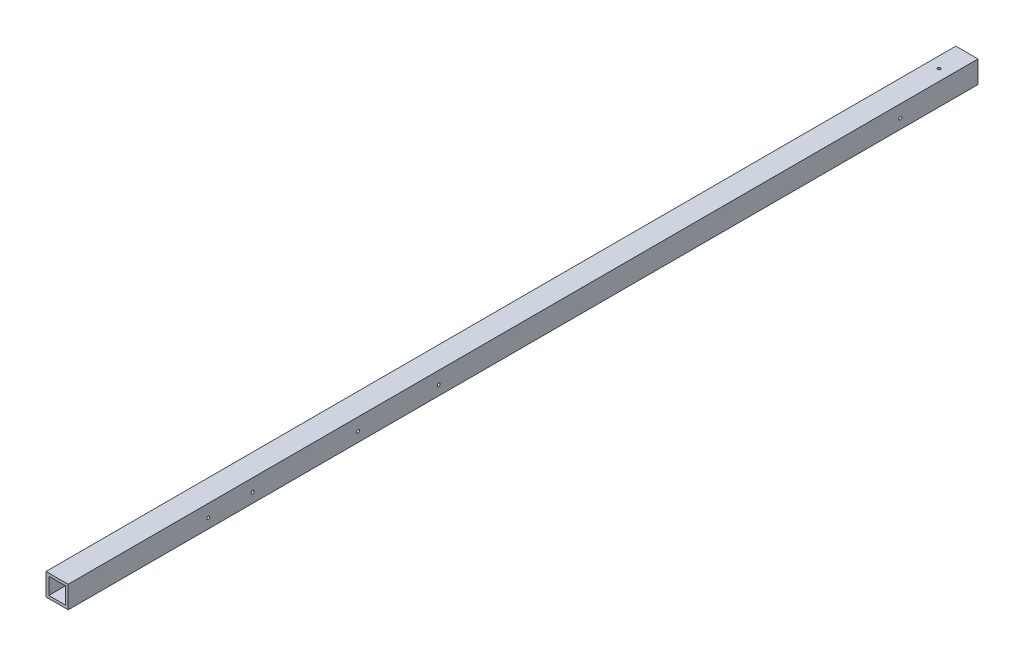
ISO-10303-21;
HEADER;
FILE_DESCRIPTION(('STEP AP214'),'2;1');
FILE_NAME('part.step','',(''),(''),'','','');
FILE_SCHEMA(('AUTOMOTIVE_DESIGN { 1 0 10303 214 1 1 1 1 }'));
ENDSEC;
DATA;
#1=APPLICATION_CONTEXT('core data for automotive mechanical design processes');
#2=APPLICATION_PROTOCOL_DEFINITION('international standard','automotive_design',2000,#1);
#3=PRODUCT_CONTEXT('',#1,'mechanical');
#4=PRODUCT('Part','Part','',(#3));
#5=PRODUCT_RELATED_PRODUCT_CATEGORY('part','',(#4));
#6=PRODUCT_DEFINITION_FORMATION('','',#4);
#7=PRODUCT_DEFINITION_CONTEXT('part definition',#1,'design');
#8=PRODUCT_DEFINITION('design','',#6,#7);
#9=PRODUCT_DEFINITION_SHAPE('','',#8);
#10=(LENGTH_UNIT() NAMED_UNIT(*) SI_UNIT(.MILLI.,.METRE.));
#11=(NAMED_UNIT(*) PLANE_ANGLE_UNIT() SI_UNIT($,.RADIAN.));
#12=(NAMED_UNIT(*) SI_UNIT($,.STERADIAN.) SOLID_ANGLE_UNIT());
#13=UNCERTAINTY_MEASURE_WITH_UNIT(LENGTH_MEASURE(1.E-05),#10,'distance_accuracy_value','');
#14=(GEOMETRIC_REPRESENTATION_CONTEXT(3) GLOBAL_UNCERTAINTY_ASSIGNED_CONTEXT((#13)) GLOBAL_UNIT_ASSIGNED_CONTEXT((#10,
#11,#12)) REPRESENTATION_CONTEXT('',''));
#15=CARTESIAN_POINT('',(0.,0.,0.));
#16=DIRECTION('',(0.,0.,1.));
#17=DIRECTION('',(1.,0.,0.));
#18=AXIS2_PLACEMENT_3D('',#15,#16,#17);
#19=CARTESIAN_POINT('',(-2287.62139438171,-193.675,1762.125));
#20=DIRECTION('',(1.,0.,0.));
#21=DIRECTION('',(0.,0.,-1.));
#22=AXIS2_PLACEMENT_3D('',#19,#20,#21);
#23=CYLINDRICAL_SURFACE('',#22,3.3782);
#24=CARTESIAN_POINT('',(-209.55,-193.675,1762.125));
#25=DIRECTION('',(1.,0.,0.));
#26=DIRECTION('',(0.,0.,-1.));
#27=AXIS2_PLACEMENT_3D('',#24,#25,#26);
#28=CIRCLE('',#27,3.3782);
#29=CARTESIAN_POINT('',(-209.55,-193.675,1758.7468));
#30=VERTEX_POINT('',#29);
#31=EDGE_CURVE('E163',#30,#30,#28,.F.);
#32=ORIENTED_EDGE('',*,*,#31,.F.);
#33=EDGE_LOOP('',(#32));
#34=FACE_BOUND('',#33,.T.);
#35=CARTESIAN_POINT('',(-212.028435125498,-193.675,1762.125));
#36=DIRECTION('',(-1.,0.,0.));
#37=DIRECTION('',(0.,0.,1.));
#38=AXIS2_PLACEMENT_3D('',#35,#36,#37);
#39=CIRCLE('',#38,3.3782);
#40=CARTESIAN_POINT('',(-212.028435125498,-193.675,1765.5032));
#41=VERTEX_POINT('',#40);
#42=EDGE_CURVE('E226',#41,#41,#39,.T.);
#43=ORIENTED_EDGE('',*,*,#42,.T.);
#44=EDGE_LOOP('',(#43));
#45=FACE_BOUND('',#44,.T.);
#46=ADVANCED_FACE('F16',(#34,#45),#23,.F.);
#47=CARTESIAN_POINT('',(-2287.62139438171,-193.675,1660.525));
#48=DIRECTION('',(1.,0.,0.));
#49=DIRECTION('',(0.,0.,-1.));
#50=AXIS2_PLACEMENT_3D('',#47,#48,#49);
#51=CYLINDRICAL_SURFACE('',#50,3.3782);
#52=CARTESIAN_POINT('',(-209.55,-193.675,1660.525));
#53=DIRECTION('',(1.,0.,0.));
#54=DIRECTION('',(0.,0.,-1.));
#55=AXIS2_PLACEMENT_3D('',#52,#53,#54);
#56=CIRCLE('',#55,3.3782);
#57=CARTESIAN_POINT('',(-209.55,-193.675,1657.1468));
#58=VERTEX_POINT('',#57);
#59=EDGE_CURVE('E169',#58,#58,#56,.F.);
#60=ORIENTED_EDGE('',*,*,#59,.F.);
#61=EDGE_LOOP('',(#60));
#62=FACE_BOUND('',#61,.T.);
#63=CARTESIAN_POINT('',(-212.028435125498,-193.675,1660.525));
#64=DIRECTION('',(-1.,0.,0.));
#65=DIRECTION('',(0.,0.,1.));
#66=AXIS2_PLACEMENT_3D('',#63,#64,#65);
#67=CIRCLE('',#66,3.3782);
#68=CARTESIAN_POINT('',(-212.028435125498,-193.675,1663.9032));
#69=VERTEX_POINT('',#68);
#70=EDGE_CURVE('E174',#69,#69,#67,.T.);
#71=ORIENTED_EDGE('',*,*,#70,.T.);
#72=EDGE_LOOP('',(#71));
#73=FACE_BOUND('',#72,.T.);
#74=ADVANCED_FACE('F411',(#62,#73),#51,.F.);
#75=CARTESIAN_POINT('',(-190.5,-171.45,2082.8));
#76=DIRECTION('',(0.,-1.,0.));
#77=DIRECTION('',(0.,0.,-1.));
#78=AXIS2_PLACEMENT_3D('',#75,#76,#77);
#79=PLANE('',#78);
#80=CARTESIAN_POINT('',(-190.5,-171.45,63.5));
#81=DIRECTION('',(0.,-1.,0.));
#82=DIRECTION('',(0.,0.,-1.));
#83=AXIS2_PLACEMENT_3D('',#80,#81,#82);
#84=CIRCLE('',#83,3.3655);
#85=CARTESIAN_POINT('',(-190.5,-171.45,60.1345));
#86=VERTEX_POINT('',#85);
#87=EDGE_CURVE('E256',#86,#86,#84,.F.);
#88=ORIENTED_EDGE('',*,*,#87,.T.);
#89=EDGE_LOOP('',(#88));
#90=FACE_BOUND('',#89,.T.);
#91=DIRECTION('',(-1.,0.,0.));
#92=VECTOR('',#91,1.);
#93=CARTESIAN_POINT('',(-190.5,-171.45,0.));
#94=LINE('',#93,#92);
#95=CARTESIAN_POINT('',(-171.45,-171.45,0.));
#96=VERTEX_POINT('',#95);
#97=CARTESIAN_POINT('',(-209.55,-171.45,0.));
#98=VERTEX_POINT('',#97);
#99=EDGE_CURVE('E293',#96,#98,#94,.T.);
#100=ORIENTED_EDGE('',*,*,#99,.F.);
#101=DIRECTION('',(0.,0.,-1.));
#102=VECTOR('',#101,1.);
#103=CARTESIAN_POINT('',(-171.45,-171.45,2082.8));
#104=LINE('',#103,#102);
#105=CARTESIAN_POINT('',(-171.45,-171.45,2082.8));
#106=VERTEX_POINT('',#105);
#107=EDGE_CURVE('E11',#106,#96,#104,.T.);
#108=ORIENTED_EDGE('',*,*,#107,.F.);
#109=DIRECTION('',(-1.,0.,0.));
#110=VECTOR('',#109,1.);
#111=CARTESIAN_POINT('',(-190.5,-171.45,2082.8));
#112=LINE('',#111,#110);
#113=CARTESIAN_POINT('',(-209.55,-171.45,2082.8));
#114=VERTEX_POINT('',#113);
#115=EDGE_CURVE('E130',#106,#114,#112,.T.);
#116=ORIENTED_EDGE('',*,*,#115,.T.);
#117=DIRECTION('',(0.,0.,-1.));
#118=VECTOR('',#117,1.);
#119=CARTESIAN_POINT('',(-209.55,-171.45,2082.8));
#120=LINE('',#119,#118);
#121=EDGE_CURVE('E41',#114,#98,#120,.T.);
#122=ORIENTED_EDGE('',*,*,#121,.T.);
#123=EDGE_LOOP('',(#100,#108,#116,#122));
#124=FACE_BOUND('',#123,.T.);
#125=ADVANCED_FACE('F406',(#90,#124),#79,.T.);
#126=CARTESIAN_POINT('',(-171.45,-190.5,2082.8));
#127=DIRECTION('',(1.,0.,0.));
#128=DIRECTION('',(0.,0.,-1.));
#129=AXIS2_PLACEMENT_3D('',#126,#127,#128);
#130=PLANE('',#129);
#131=CARTESIAN_POINT('',(-171.45,-193.675,1419.225));
#132=DIRECTION('',(1.,0.,0.));
#133=DIRECTION('',(0.,0.,-1.));
#134=AXIS2_PLACEMENT_3D('',#131,#132,#133);
#135=CIRCLE('',#134,3.3782);
#136=CARTESIAN_POINT('',(-171.45,-193.675,1415.8468));
#137=VERTEX_POINT('',#136);
#138=EDGE_CURVE('E201',#137,#137,#135,.F.);
#139=ORIENTED_EDGE('',*,*,#138,.F.);
#140=EDGE_LOOP('',(#139));
#141=FACE_BOUND('',#140,.T.);
#142=CARTESIAN_POINT('',(-171.45,-193.675,177.8));
#143=DIRECTION('',(1.,0.,0.));
#144=DIRECTION('',(0.,0.,-1.));
#145=AXIS2_PLACEMENT_3D('',#142,#143,#144);
#146=CIRCLE('',#145,3.3782);
#147=CARTESIAN_POINT('',(-171.45,-193.675,174.4218));
#148=VERTEX_POINT('',#147);
#149=EDGE_CURVE('E191',#148,#148,#146,.F.);
#150=ORIENTED_EDGE('',*,*,#149,.F.);
#151=EDGE_LOOP('',(#150));
#152=FACE_BOUND('',#151,.T.);
#153=CARTESIAN_POINT('',(-171.45,-193.675,1234.5416));
#154=DIRECTION('',(1.,0.,0.));
#155=DIRECTION('',(0.,0.,-1.));
#156=AXIS2_PLACEMENT_3D('',#153,#154,#155);
#157=CIRCLE('',#156,3.3782);
#158=CARTESIAN_POINT('',(-171.45,-193.675,1231.1634));
#159=VERTEX_POINT('',#158);
#160=EDGE_CURVE('E218',#159,#159,#157,.F.);
#161=ORIENTED_EDGE('',*,*,#160,.F.);
#162=EDGE_LOOP('',(#161));
#163=FACE_BOUND('',#162,.T.);
#164=CARTESIAN_POINT('',(-171.45,-193.675,1660.525));
#165=DIRECTION('',(1.,0.,0.));
#166=DIRECTION('',(0.,0.,-1.));
#167=AXIS2_PLACEMENT_3D('',#164,#165,#166);
#168=CIRCLE('',#167,3.3782);
#169=CARTESIAN_POINT('',(-171.45,-193.675,1657.1468));
#170=VERTEX_POINT('',#169);
#171=EDGE_CURVE('E168',#170,#170,#168,.F.);
#172=ORIENTED_EDGE('',*,*,#171,.F.);
#173=EDGE_LOOP('',(#172));
#174=FACE_BOUND('',#173,.T.);
#175=CARTESIAN_POINT('',(-171.45,-193.675,1762.125));
#176=DIRECTION('',(1.,0.,0.));
#177=DIRECTION('',(0.,0.,-1.));
#178=AXIS2_PLACEMENT_3D('',#175,#176,#177);
#179=CIRCLE('',#178,3.3782);
#180=CARTESIAN_POINT('',(-171.45,-193.675,1758.7468));
#181=VERTEX_POINT('',#180);
#182=EDGE_CURVE('E246',#181,#181,#179,.F.);
#183=ORIENTED_EDGE('',*,*,#182,.F.);
#184=EDGE_LOOP('',(#183));
#185=FACE_BOUND('',#184,.T.);
#186=DIRECTION('',(0.,-1.,0.));
#187=VECTOR('',#186,1.);
#188=CARTESIAN_POINT('',(-171.45,-190.5,0.));
#189=LINE('',#188,#187);
#190=CARTESIAN_POINT('',(-171.45,-209.55,0.));
#191=VERTEX_POINT('',#190);
#192=EDGE_CURVE('E136',#96,#191,#189,.T.);
#193=ORIENTED_EDGE('',*,*,#192,.T.);
#194=DIRECTION('',(0.,0.,-1.));
#195=VECTOR('',#194,1.);
#196=CARTESIAN_POINT('',(-171.45,-209.55,2082.8));
#197=LINE('',#196,#195);
#198=CARTESIAN_POINT('',(-171.45,-209.55,2082.8));
#199=VERTEX_POINT('',#198);
#200=EDGE_CURVE('E27',#199,#191,#197,.T.);
#201=ORIENTED_EDGE('',*,*,#200,.F.);
#202=DIRECTION('',(0.,-1.,0.));
#203=VECTOR('',#202,1.);
#204=CARTESIAN_POINT('',(-171.45,-190.5,2082.8));
#205=LINE('',#204,#203);
#206=EDGE_CURVE('E125',#106,#199,#205,.T.);
#207=ORIENTED_EDGE('',*,*,#206,.F.);
#208=ORIENTED_EDGE('',*,*,#107,.T.);
#209=EDGE_LOOP('',(#193,#201,#207,#208));
#210=FACE_BOUND('',#209,.T.);
#211=ADVANCED_FACE('F134',(#141,#152,#163,#174,#185,#210),#130,.F.);
#212=CARTESIAN_POINT('',(-190.5,-209.55,2082.8));
#213=DIRECTION('',(0.,-1.,0.));
#214=DIRECTION('',(0.,0.,-1.));
#215=AXIS2_PLACEMENT_3D('',#212,#213,#214);
#216=PLANE('',#215);
#217=CARTESIAN_POINT('',(-190.5,-209.55,63.5));
#218=DIRECTION('',(0.,-1.,0.));
#219=DIRECTION('',(0.,0.,-1.));
#220=AXIS2_PLACEMENT_3D('',#217,#218,#219);
#221=CIRCLE('',#220,3.3655);
#222=CARTESIAN_POINT('',(-190.5,-209.55,60.1345));
#223=VERTEX_POINT('',#222);
#224=EDGE_CURVE('E161',#223,#223,#221,.F.);
#225=ORIENTED_EDGE('',*,*,#224,.F.);
#226=EDGE_LOOP('',(#225));
#227=FACE_BOUND('',#226,.T.);
#228=DIRECTION('',(-1.,0.,0.));
#229=VECTOR('',#228,1.);
#230=CARTESIAN_POINT('',(-190.5,-209.55,0.));
#231=LINE('',#230,#229);
#232=CARTESIAN_POINT('',(-209.55,-209.55,0.));
#233=VERTEX_POINT('',#232);
#234=EDGE_CURVE('E298',#191,#233,#231,.T.);
#235=ORIENTED_EDGE('',*,*,#234,.T.);
#236=DIRECTION('',(0.,0.,-1.));
#237=VECTOR('',#236,1.);
#238=CARTESIAN_POINT('',(-209.55,-209.55,2082.8));
#239=LINE('',#238,#237);
#240=CARTESIAN_POINT('',(-209.55,-209.55,2082.8));
#241=VERTEX_POINT('',#240);
#242=EDGE_CURVE('E77',#241,#233,#239,.T.);
#243=ORIENTED_EDGE('',*,*,#242,.F.);
#244=DIRECTION('',(-1.,0.,0.));
#245=VECTOR('',#244,1.);
#246=CARTESIAN_POINT('',(-190.5,-209.55,2082.8));
#247=LINE('',#246,#245);
#248=EDGE_CURVE('E116',#199,#241,#247,.T.);
#249=ORIENTED_EDGE('',*,*,#248,.F.);
#250=ORIENTED_EDGE('',*,*,#200,.T.);
#251=EDGE_LOOP('',(#235,#243,#249,#250));
#252=FACE_BOUND('',#251,.T.);
#253=ADVANCED_FACE('F118',(#227,#252),#216,.F.);
#254=CARTESIAN_POINT('',(-215.9,-190.5,2082.8));
#255=DIRECTION('',(-1.,0.,0.));
#256=DIRECTION('',(0.,0.,1.));
#257=AXIS2_PLACEMENT_3D('',#254,#255,#256);
#258=PLANE('',#257);
#259=CARTESIAN_POINT('',(-215.9,-193.675,1419.225));
#260=DIRECTION('',(-1.,0.,0.));
#261=DIRECTION('',(0.,0.,1.));
#262=AXIS2_PLACEMENT_3D('',#259,#260,#261);
#263=CIRCLE('',#262,6.74369999999991);
#264=CARTESIAN_POINT('',(-215.9,-193.675,1425.9687));
#265=VERTEX_POINT('',#264);
#266=EDGE_CURVE('E714',#265,#265,#263,.T.);
#267=ORIENTED_EDGE('',*,*,#266,.F.);
#268=EDGE_LOOP('',(#267));
#269=FACE_BOUND('',#268,.T.);
#270=CARTESIAN_POINT('',(-215.9,-193.675,177.8));
#271=DIRECTION('',(-1.,0.,0.));
#272=DIRECTION('',(0.,0.,1.));
#273=AXIS2_PLACEMENT_3D('',#270,#271,#272);
#274=CIRCLE('',#273,6.7437);
#275=CARTESIAN_POINT('',(-215.9,-193.675,184.5437));
#276=VERTEX_POINT('',#275);
#277=EDGE_CURVE('E194',#276,#276,#274,.T.);
#278=ORIENTED_EDGE('',*,*,#277,.F.);
#279=EDGE_LOOP('',(#278));
#280=FACE_BOUND('',#279,.T.);
#281=CARTESIAN_POINT('',(-215.9,-193.675,1234.5416));
#282=DIRECTION('',(-1.,0.,0.));
#283=DIRECTION('',(0.,0.,1.));
#284=AXIS2_PLACEMENT_3D('',#281,#282,#283);
#285=CIRCLE('',#284,6.74369999999991);
#286=CARTESIAN_POINT('',(-215.9,-193.675,1241.2853));
#287=VERTEX_POINT('',#286);
#288=EDGE_CURVE('E208',#287,#287,#285,.T.);
#289=ORIENTED_EDGE('',*,*,#288,.F.);
#290=EDGE_LOOP('',(#289));
#291=FACE_BOUND('',#290,.T.);
#292=CARTESIAN_POINT('',(-215.9,-193.675,1762.125));
#293=DIRECTION('',(-1.,0.,0.));
#294=DIRECTION('',(0.,0.,1.));
#295=AXIS2_PLACEMENT_3D('',#292,#293,#294);
#296=CIRCLE('',#295,6.74369999999991);
#297=CARTESIAN_POINT('',(-215.9,-193.675,1768.8687));
#298=VERTEX_POINT('',#297);
#299=EDGE_CURVE('E222',#298,#298,#296,.T.);
#300=ORIENTED_EDGE('',*,*,#299,.F.);
#301=EDGE_LOOP('',(#300));
#302=FACE_BOUND('',#301,.T.);
#303=CARTESIAN_POINT('',(-215.9,-193.675,1660.525));
#304=DIRECTION('',(-1.,0.,0.));
#305=DIRECTION('',(0.,0.,1.));
#306=AXIS2_PLACEMENT_3D('',#303,#304,#305);
#307=CIRCLE('',#306,6.74369999999991);
#308=CARTESIAN_POINT('',(-215.9,-193.675,1667.2687));
#309=VERTEX_POINT('',#308);
#310=EDGE_CURVE('E230',#309,#309,#307,.T.);
#311=ORIENTED_EDGE('',*,*,#310,.F.);
#312=EDGE_LOOP('',(#311));
#313=FACE_BOUND('',#312,.T.);
#314=DIRECTION('',(0.,1.,0.));
#315=VECTOR('',#314,1.);
#316=CARTESIAN_POINT('',(-215.9,-190.5,0.));
#317=LINE('',#316,#315);
#318=CARTESIAN_POINT('',(-215.9,-215.9,0.));
#319=VERTEX_POINT('',#318);
#320=CARTESIAN_POINT('',(-215.9,-165.1,0.));
#321=VERTEX_POINT('',#320);
#322=EDGE_CURVE('E260',#319,#321,#317,.T.);
#323=ORIENTED_EDGE('',*,*,#322,.F.);
#324=DIRECTION('',(0.,0.,-1.));
#325=VECTOR('',#324,1.);
#326=CARTESIAN_POINT('',(-215.9,-215.9,2082.8));
#327=LINE('',#326,#325);
#328=CARTESIAN_POINT('',(-215.9,-215.9,2082.8));
#329=VERTEX_POINT('',#328);
#330=EDGE_CURVE('E94',#329,#319,#327,.T.);
#331=ORIENTED_EDGE('',*,*,#330,.F.);
#332=DIRECTION('',(0.,1.,0.));
#333=VECTOR('',#332,1.);
#334=CARTESIAN_POINT('',(-215.9,-190.5,2082.8));
#335=LINE('',#334,#333);
#336=CARTESIAN_POINT('',(-215.9,-165.1,2082.8));
#337=VERTEX_POINT('',#336);
#338=EDGE_CURVE('E261',#329,#337,#335,.T.);
#339=ORIENTED_EDGE('',*,*,#338,.T.);
#340=DIRECTION('',(0.,0.,-1.));
#341=VECTOR('',#340,1.);
#342=CARTESIAN_POINT('',(-215.9,-165.1,2082.8));
#343=LINE('',#342,#341);
#344=EDGE_CURVE('E147',#337,#321,#343,.T.);
#345=ORIENTED_EDGE('',*,*,#344,.T.);
#346=EDGE_LOOP('',(#323,#331,#339,#345));
#347=FACE_BOUND('',#346,.T.);
#348=ADVANCED_FACE('F18',(#269,#280,#291,#302,#313,#347),#258,.T.);
#349=CARTESIAN_POINT('',(-190.5,-215.9,2082.8));
#350=DIRECTION('',(0.,1.,0.));
#351=DIRECTION('',(0.,0.,1.));
#352=AXIS2_PLACEMENT_3D('',#349,#350,#351);
#353=PLANE('',#352);
#354=CARTESIAN_POINT('',(-190.5,-215.9,63.5));
#355=DIRECTION('',(0.,-1.,0.));
#356=DIRECTION('',(0.,0.,-1.));
#357=AXIS2_PLACEMENT_3D('',#354,#355,#356);
#358=CIRCLE('',#357,3.3655);
#359=CARTESIAN_POINT('',(-190.5,-215.9,60.1345));
#360=VERTEX_POINT('',#359);
#361=EDGE_CURVE('E162',#360,#360,#358,.T.);
#362=ORIENTED_EDGE('',*,*,#361,.F.);
#363=EDGE_LOOP('',(#362));
#364=FACE_BOUND('',#363,.T.);
#365=DIRECTION('',(1.,0.,0.));
#366=VECTOR('',#365,1.);
#367=CARTESIAN_POINT('',(-190.5,-215.9,0.));
#368=LINE('',#367,#366);
#369=CARTESIAN_POINT('',(-165.1,-215.9,0.));
#370=VERTEX_POINT('',#369);
#371=EDGE_CURVE('E282',#319,#370,#368,.T.);
#372=ORIENTED_EDGE('',*,*,#371,.T.);
#373=DIRECTION('',(0.,0.,-1.));
#374=VECTOR('',#373,1.);
#375=CARTESIAN_POINT('',(-165.1,-215.9,2082.8));
#376=LINE('',#375,#374);
#377=CARTESIAN_POINT('',(-165.1,-215.9,2082.8));
#378=VERTEX_POINT('',#377);
#379=EDGE_CURVE('E152',#378,#370,#376,.T.);
#380=ORIENTED_EDGE('',*,*,#379,.F.);
#381=DIRECTION('',(1.,0.,0.));
#382=VECTOR('',#381,1.);
#383=CARTESIAN_POINT('',(-190.5,-215.9,2082.8));
#384=LINE('',#383,#382);
#385=EDGE_CURVE('E264',#329,#378,#384,.T.);
#386=ORIENTED_EDGE('',*,*,#385,.F.);
#387=ORIENTED_EDGE('',*,*,#330,.T.);
#388=EDGE_LOOP('',(#372,#380,#386,#387));
#389=FACE_BOUND('',#388,.T.);
#390=ADVANCED_FACE('F384',(#364,#389),#353,.F.);
#391=CARTESIAN_POINT('',(-165.1,-190.5,2082.8));
#392=DIRECTION('',(-1.,0.,0.));
#393=DIRECTION('',(0.,0.,1.));
#394=AXIS2_PLACEMENT_3D('',#391,#392,#393);
#395=PLANE('',#394);
#396=CARTESIAN_POINT('',(-165.1,-193.675,1419.225));
#397=DIRECTION('',(-1.,0.,0.));
#398=DIRECTION('',(0.,0.,1.));
#399=AXIS2_PLACEMENT_3D('',#396,#397,#398);
#400=CIRCLE('',#399,3.3782);
#401=CARTESIAN_POINT('',(-165.1,-193.675,1422.6032));
#402=VERTEX_POINT('',#401);
#403=EDGE_CURVE('E702',#402,#402,#400,.F.);
#404=ORIENTED_EDGE('',*,*,#403,.F.);
#405=EDGE_LOOP('',(#404));
#406=FACE_BOUND('',#405,.T.);
#407=CARTESIAN_POINT('',(-165.1,-193.675,177.8));
#408=DIRECTION('',(-1.,0.,0.));
#409=DIRECTION('',(0.,0.,1.));
#410=AXIS2_PLACEMENT_3D('',#407,#408,#409);
#411=CIRCLE('',#410,3.3782);
#412=CARTESIAN_POINT('',(-165.1,-193.675,181.1782));
#413=VERTEX_POINT('',#412);
#414=EDGE_CURVE('E183',#413,#413,#411,.F.);
#415=ORIENTED_EDGE('',*,*,#414,.F.);
#416=EDGE_LOOP('',(#415));
#417=FACE_BOUND('',#416,.T.);
#418=CARTESIAN_POINT('',(-165.1,-193.675,1234.5416));
#419=DIRECTION('',(-1.,0.,0.));
#420=DIRECTION('',(0.,0.,1.));
#421=AXIS2_PLACEMENT_3D('',#418,#419,#420);
#422=CIRCLE('',#421,3.3782);
#423=CARTESIAN_POINT('',(-165.1,-193.675,1237.9198));
#424=VERTEX_POINT('',#423);
#425=EDGE_CURVE('E178',#424,#424,#422,.F.);
#426=ORIENTED_EDGE('',*,*,#425,.F.);
#427=EDGE_LOOP('',(#426));
#428=FACE_BOUND('',#427,.T.);
#429=CARTESIAN_POINT('',(-165.1,-193.675,1660.525));
#430=DIRECTION('',(-1.,0.,0.));
#431=DIRECTION('',(0.,0.,1.));
#432=AXIS2_PLACEMENT_3D('',#429,#430,#431);
#433=CIRCLE('',#432,3.3782);
#434=CARTESIAN_POINT('',(-165.1,-193.675,1663.9032));
#435=VERTEX_POINT('',#434);
#436=EDGE_CURVE('E173',#435,#435,#433,.F.);
#437=ORIENTED_EDGE('',*,*,#436,.F.);
#438=EDGE_LOOP('',(#437));
#439=FACE_BOUND('',#438,.T.);
#440=CARTESIAN_POINT('',(-165.1,-193.675,1762.125));
#441=DIRECTION('',(-1.,0.,0.));
#442=DIRECTION('',(0.,0.,1.));
#443=AXIS2_PLACEMENT_3D('',#440,#441,#442);
#444=CIRCLE('',#443,3.3782);
#445=CARTESIAN_POINT('',(-165.1,-193.675,1765.5032));
#446=VERTEX_POINT('',#445);
#447=EDGE_CURVE('E167',#446,#446,#444,.F.);
#448=ORIENTED_EDGE('',*,*,#447,.F.);
#449=EDGE_LOOP('',(#448));
#450=FACE_BOUND('',#449,.T.);
#451=DIRECTION('',(0.,1.,0.));
#452=VECTOR('',#451,1.);
#453=CARTESIAN_POINT('',(-165.1,-190.5,0.));
#454=LINE('',#453,#452);
#455=CARTESIAN_POINT('',(-165.1,-165.1,0.));
#456=VERTEX_POINT('',#455);
#457=EDGE_CURVE('E285',#370,#456,#454,.T.);
#458=ORIENTED_EDGE('',*,*,#457,.T.);
#459=DIRECTION('',(0.,0.,-1.));
#460=VECTOR('',#459,1.);
#461=CARTESIAN_POINT('',(-165.1,-165.1,2082.8));
#462=LINE('',#461,#460);
#463=CARTESIAN_POINT('',(-165.1,-165.1,2082.8));
#464=VERTEX_POINT('',#463);
#465=EDGE_CURVE('E150',#464,#456,#462,.T.);
#466=ORIENTED_EDGE('',*,*,#465,.F.);
#467=DIRECTION('',(0.,1.,0.));
#468=VECTOR('',#467,1.);
#469=CARTESIAN_POINT('',(-165.1,-190.5,2082.8));
#470=LINE('',#469,#468);
#471=EDGE_CURVE('E268',#378,#464,#470,.T.);
#472=ORIENTED_EDGE('',*,*,#471,.F.);
#473=ORIENTED_EDGE('',*,*,#379,.T.);
#474=EDGE_LOOP('',(#458,#466,#472,#473));
#475=FACE_BOUND('',#474,.T.);
#476=ADVANCED_FACE('F389',(#406,#417,#428,#439,#450,#475),#395,.F.);
#477=CARTESIAN_POINT('',(-190.5,-165.1,2082.8));
#478=DIRECTION('',(0.,1.,0.));
#479=DIRECTION('',(0.,0.,1.));
#480=AXIS2_PLACEMENT_3D('',#477,#478,#479);
#481=PLANE('',#480);
#482=CARTESIAN_POINT('',(-190.5,-165.1,63.5));
#483=DIRECTION('',(0.,1.,0.));
#484=DIRECTION('',(0.,0.,1.));
#485=AXIS2_PLACEMENT_3D('',#482,#483,#484);
#486=CIRCLE('',#485,3.3655);
#487=CARTESIAN_POINT('',(-190.5,-165.1,66.8655));
#488=VERTEX_POINT('',#487);
#489=EDGE_CURVE('E157',#488,#488,#486,.F.);
#490=ORIENTED_EDGE('',*,*,#489,.T.);
#491=EDGE_LOOP('',(#490));
#492=FACE_BOUND('',#491,.T.);
#493=DIRECTION('',(1.,0.,0.));
#494=VECTOR('',#493,1.);
#495=CARTESIAN_POINT('',(-190.5,-165.1,0.));
#496=LINE('',#495,#494);
#497=EDGE_CURVE('E289',#321,#456,#496,.T.);
#498=ORIENTED_EDGE('',*,*,#497,.F.);
#499=ORIENTED_EDGE('',*,*,#344,.F.);
#500=DIRECTION('',(1.,0.,0.));
#501=VECTOR('',#500,1.);
#502=CARTESIAN_POINT('',(-190.5,-165.1,2082.8));
#503=LINE('',#502,#501);
#504=EDGE_CURVE('E271',#337,#464,#503,.T.);
#505=ORIENTED_EDGE('',*,*,#504,.T.);
#506=ORIENTED_EDGE('',*,*,#465,.T.);
#507=EDGE_LOOP('',(#498,#499,#505,#506));
#508=FACE_BOUND('',#507,.T.);
#509=ADVANCED_FACE('F396',(#492,#508),#481,.T.);
#510=CARTESIAN_POINT('',(-209.55,-190.5,2082.8));
#511=DIRECTION('',(1.,0.,0.));
#512=DIRECTION('',(0.,0.,-1.));
#513=AXIS2_PLACEMENT_3D('',#510,#511,#512);
#514=PLANE('',#513);
#515=CARTESIAN_POINT('',(-209.55,-193.675,1419.225));
#516=DIRECTION('',(1.,0.,0.));
#517=DIRECTION('',(0.,0.,-1.));
#518=AXIS2_PLACEMENT_3D('',#515,#516,#517);
#519=CIRCLE('',#518,3.3782);
#520=CARTESIAN_POINT('',(-209.55,-193.675,1415.8468));
#521=VERTEX_POINT('',#520);
#522=EDGE_CURVE('E20',#521,#521,#519,.F.);
#523=ORIENTED_EDGE('',*,*,#522,.T.);
#524=EDGE_LOOP('',(#523));
#525=FACE_BOUND('',#524,.T.);
#526=CARTESIAN_POINT('',(-209.55,-193.675,177.8));
#527=DIRECTION('',(1.,0.,0.));
#528=DIRECTION('',(0.,0.,-1.));
#529=AXIS2_PLACEMENT_3D('',#526,#527,#528);
#530=CIRCLE('',#529,3.3782);
#531=CARTESIAN_POINT('',(-209.55,-193.675,174.4218));
#532=VERTEX_POINT('',#531);
#533=EDGE_CURVE('E180',#532,#532,#530,.F.);
#534=ORIENTED_EDGE('',*,*,#533,.T.);
#535=EDGE_LOOP('',(#534));
#536=FACE_BOUND('',#535,.T.);
#537=CARTESIAN_POINT('',(-209.55,-193.675,1234.5416));
#538=DIRECTION('',(1.,0.,0.));
#539=DIRECTION('',(0.,0.,-1.));
#540=AXIS2_PLACEMENT_3D('',#537,#538,#539);
#541=CIRCLE('',#540,3.3782);
#542=CARTESIAN_POINT('',(-209.55,-193.675,1231.1634));
#543=VERTEX_POINT('',#542);
#544=EDGE_CURVE('E175',#543,#543,#541,.F.);
#545=ORIENTED_EDGE('',*,*,#544,.T.);
#546=EDGE_LOOP('',(#545));
#547=FACE_BOUND('',#546,.T.);
#548=ORIENTED_EDGE('',*,*,#59,.T.);
#549=EDGE_LOOP('',(#548));
#550=FACE_BOUND('',#549,.T.);
#551=ORIENTED_EDGE('',*,*,#31,.T.);
#552=EDGE_LOOP('',(#551));
#553=FACE_BOUND('',#552,.T.);
#554=DIRECTION('',(0.,-1.,0.));
#555=VECTOR('',#554,1.);
#556=CARTESIAN_POINT('',(-209.55,-190.5,0.));
#557=LINE('',#556,#555);
#558=EDGE_CURVE('E265',#98,#233,#557,.T.);
#559=ORIENTED_EDGE('',*,*,#558,.F.);
#560=ORIENTED_EDGE('',*,*,#121,.F.);
#561=DIRECTION('',(0.,-1.,0.));
#562=VECTOR('',#561,1.);
#563=CARTESIAN_POINT('',(-209.55,-190.5,2082.8));
#564=LINE('',#563,#562);
#565=EDGE_CURVE('E124',#114,#241,#564,.T.);
#566=ORIENTED_EDGE('',*,*,#565,.T.);
#567=ORIENTED_EDGE('',*,*,#242,.T.);
#568=EDGE_LOOP('',(#559,#560,#566,#567));
#569=FACE_BOUND('',#568,.T.);
#570=ADVANCED_FACE('F369',(#525,#536,#547,#550,#553,#569),#514,.T.);
#571=CARTESIAN_POINT('',(-190.5,-190.5,2082.8));
#572=DIRECTION('',(0.,0.,1.));
#573=DIRECTION('',(1.,0.,0.));
#574=AXIS2_PLACEMENT_3D('',#571,#572,#573);
#575=PLANE('',#574);
#576=ORIENTED_EDGE('',*,*,#338,.F.);
#577=ORIENTED_EDGE('',*,*,#385,.T.);
#578=ORIENTED_EDGE('',*,*,#471,.T.);
#579=ORIENTED_EDGE('',*,*,#504,.F.);
#580=EDGE_LOOP('',(#576,#577,#578,#579));
#581=FACE_BOUND('',#580,.T.);
#582=ORIENTED_EDGE('',*,*,#115,.F.);
#583=ORIENTED_EDGE('',*,*,#206,.T.);
#584=ORIENTED_EDGE('',*,*,#248,.T.);
#585=ORIENTED_EDGE('',*,*,#565,.F.);
#586=EDGE_LOOP('',(#582,#583,#584,#585));
#587=FACE_BOUND('',#586,.T.);
#588=ADVANCED_FACE('F129',(#581,#587),#575,.T.);
#589=CARTESIAN_POINT('',(-190.5,-190.5,0.));
#590=DIRECTION('',(0.,0.,1.));
#591=DIRECTION('',(1.,0.,0.));
#592=AXIS2_PLACEMENT_3D('',#589,#590,#591);
#593=PLANE('',#592);
#594=ORIENTED_EDGE('',*,*,#322,.T.);
#595=ORIENTED_EDGE('',*,*,#497,.T.);
#596=ORIENTED_EDGE('',*,*,#457,.F.);
#597=ORIENTED_EDGE('',*,*,#371,.F.);
#598=EDGE_LOOP('',(#594,#595,#596,#597));
#599=FACE_BOUND('',#598,.T.);
#600=ORIENTED_EDGE('',*,*,#99,.T.);
#601=ORIENTED_EDGE('',*,*,#558,.T.);
#602=ORIENTED_EDGE('',*,*,#234,.F.);
#603=ORIENTED_EDGE('',*,*,#192,.F.);
#604=EDGE_LOOP('',(#600,#601,#602,#603));
#605=FACE_BOUND('',#604,.T.);
#606=ADVANCED_FACE('F352',(#599,#605),#593,.F.);
#607=CARTESIAN_POINT('',(-190.5,1869.1497542781,63.5));
#608=DIRECTION('',(0.,-1.,0.));
#609=DIRECTION('',(0.,0.,-1.));
#610=AXIS2_PLACEMENT_3D('',#607,#608,#609);
#611=CYLINDRICAL_SURFACE('',#610,3.3655);
#612=ORIENTED_EDGE('',*,*,#87,.F.);
#613=EDGE_LOOP('',(#612));
#614=FACE_BOUND('',#613,.T.);
#615=ORIENTED_EDGE('',*,*,#489,.F.);
#616=EDGE_LOOP('',(#615));
#617=FACE_BOUND('',#616,.T.);
#618=ADVANCED_FACE('F357',(#614,#617),#611,.F.);
#619=ORIENTED_EDGE('',*,*,#361,.T.);
#620=EDGE_LOOP('',(#619));
#621=FACE_BOUND('',#620,.T.);
#622=ORIENTED_EDGE('',*,*,#224,.T.);
#623=EDGE_LOOP('',(#622));
#624=FACE_BOUND('',#623,.T.);
#625=ADVANCED_FACE('F434',(#621,#624),#611,.F.);
#626=ORIENTED_EDGE('',*,*,#447,.T.);
#627=EDGE_LOOP('',(#626));
#628=FACE_BOUND('',#627,.T.);
#629=ORIENTED_EDGE('',*,*,#182,.T.);
#630=EDGE_LOOP('',(#629));
#631=FACE_BOUND('',#630,.T.);
#632=ADVANCED_FACE('F439',(#628,#631),#23,.F.);
#633=ORIENTED_EDGE('',*,*,#436,.T.);
#634=EDGE_LOOP('',(#633));
#635=FACE_BOUND('',#634,.T.);
#636=ORIENTED_EDGE('',*,*,#171,.T.);
#637=EDGE_LOOP('',(#636));
#638=FACE_BOUND('',#637,.T.);
#639=ADVANCED_FACE('F458',(#635,#638),#51,.F.);
#640=CARTESIAN_POINT('',(-212.028435125498,-193.675,1660.525));
#641=DIRECTION('',(-1.,0.,0.));
#642=DIRECTION('',(0.,0.,1.));
#643=AXIS2_PLACEMENT_3D('',#640,#641,#642);
#644=CONICAL_SURFACE('',#643,3.3782,0.715584993317698);
#645=ORIENTED_EDGE('',*,*,#310,.T.);
#646=EDGE_LOOP('',(#645));
#647=FACE_BOUND('',#646,.T.);
#648=ORIENTED_EDGE('',*,*,#70,.F.);
#649=EDGE_LOOP('',(#648));
#650=FACE_BOUND('',#649,.T.);
#651=ADVANCED_FACE('F471',(#647,#650),#644,.F.);
#652=CARTESIAN_POINT('',(-212.028435125498,-193.675,1762.125));
#653=DIRECTION('',(-1.,0.,0.));
#654=DIRECTION('',(0.,0.,1.));
#655=AXIS2_PLACEMENT_3D('',#652,#653,#654);
#656=CONICAL_SURFACE('',#655,3.3782,0.715584993317698);
#657=ORIENTED_EDGE('',*,*,#299,.T.);
#658=EDGE_LOOP('',(#657));
#659=FACE_BOUND('',#658,.T.);
#660=ORIENTED_EDGE('',*,*,#42,.F.);
#661=EDGE_LOOP('',(#660));
#662=FACE_BOUND('',#661,.T.);
#663=ADVANCED_FACE('F484',(#659,#662),#656,.F.);
#664=CARTESIAN_POINT('',(1869.15356974302,-193.675,1234.5416));
#665=DIRECTION('',(-1.,0.,0.));
#666=DIRECTION('',(0.,0.,1.));
#667=AXIS2_PLACEMENT_3D('',#664,#665,#666);
#668=CYLINDRICAL_SURFACE('',#667,3.3782);
#669=ORIENTED_EDGE('',*,*,#544,.F.);
#670=EDGE_LOOP('',(#669));
#671=FACE_BOUND('',#670,.T.);
#672=CARTESIAN_POINT('',(-212.028435125498,-193.675,1234.5416));
#673=DIRECTION('',(-1.,0.,0.));
#674=DIRECTION('',(0.,0.,1.));
#675=AXIS2_PLACEMENT_3D('',#672,#673,#674);
#676=CIRCLE('',#675,3.3782);
#677=CARTESIAN_POINT('',(-212.028435125498,-193.675,1237.9198));
#678=VERTEX_POINT('',#677);
#679=EDGE_CURVE('E179',#678,#678,#676,.T.);
#680=ORIENTED_EDGE('',*,*,#679,.T.);
#681=EDGE_LOOP('',(#680));
#682=FACE_BOUND('',#681,.T.);
#683=ADVANCED_FACE('F504',(#671,#682),#668,.F.);
#684=CARTESIAN_POINT('',(-212.028435125498,-193.675,1234.5416));
#685=DIRECTION('',(-1.,0.,0.));
#686=DIRECTION('',(0.,0.,1.));
#687=AXIS2_PLACEMENT_3D('',#684,#685,#686);
#688=CONICAL_SURFACE('',#687,3.3782,0.715584993317698);
#689=ORIENTED_EDGE('',*,*,#288,.T.);
#690=EDGE_LOOP('',(#689));
#691=FACE_BOUND('',#690,.T.);
#692=ORIENTED_EDGE('',*,*,#679,.F.);
#693=EDGE_LOOP('',(#692));
#694=FACE_BOUND('',#693,.T.);
#695=ADVANCED_FACE('F520',(#691,#694),#688,.F.);
#696=ORIENTED_EDGE('',*,*,#425,.T.);
#697=EDGE_LOOP('',(#696));
#698=FACE_BOUND('',#697,.T.);
#699=ORIENTED_EDGE('',*,*,#160,.T.);
#700=EDGE_LOOP('',(#699));
#701=FACE_BOUND('',#700,.T.);
#702=ADVANCED_FACE('F524',(#698,#701),#668,.F.);
#703=CARTESIAN_POINT('',(1869.15356974302,-193.675,177.8));
#704=DIRECTION('',(-1.,0.,0.));
#705=DIRECTION('',(0.,0.,1.));
#706=AXIS2_PLACEMENT_3D('',#703,#704,#705);
#707=CYLINDRICAL_SURFACE('',#706,3.3782);
#708=ORIENTED_EDGE('',*,*,#533,.F.);
#709=EDGE_LOOP('',(#708));
#710=FACE_BOUND('',#709,.T.);
#711=CARTESIAN_POINT('',(-212.028435125498,-193.675,177.8));
#712=DIRECTION('',(-1.,0.,0.));
#713=DIRECTION('',(0.,0.,1.));
#714=AXIS2_PLACEMENT_3D('',#711,#712,#713);
#715=CIRCLE('',#714,3.3782);
#716=CARTESIAN_POINT('',(-212.028435125498,-193.675,181.1782));
#717=VERTEX_POINT('',#716);
#718=EDGE_CURVE('E184',#717,#717,#715,.T.);
#719=ORIENTED_EDGE('',*,*,#718,.T.);
#720=EDGE_LOOP('',(#719));
#721=FACE_BOUND('',#720,.T.);
#722=ADVANCED_FACE('F546',(#710,#721),#707,.F.);
#723=CARTESIAN_POINT('',(-212.028435125498,-193.675,177.8));
#724=DIRECTION('',(-1.,0.,0.));
#725=DIRECTION('',(0.,0.,1.));
#726=AXIS2_PLACEMENT_3D('',#723,#724,#725);
#727=CONICAL_SURFACE('',#726,3.3782,0.71558499331771);
#728=ORIENTED_EDGE('',*,*,#277,.T.);
#729=EDGE_LOOP('',(#728));
#730=FACE_BOUND('',#729,.T.);
#731=ORIENTED_EDGE('',*,*,#718,.F.);
#732=EDGE_LOOP('',(#731));
#733=FACE_BOUND('',#732,.T.);
#734=ADVANCED_FACE('F554',(#730,#733),#727,.F.);
#735=ORIENTED_EDGE('',*,*,#414,.T.);
#736=EDGE_LOOP('',(#735));
#737=FACE_BOUND('',#736,.T.);
#738=ORIENTED_EDGE('',*,*,#149,.T.);
#739=EDGE_LOOP('',(#738));
#740=FACE_BOUND('',#739,.T.);
#741=ADVANCED_FACE('F558',(#737,#740),#707,.F.);
#742=CARTESIAN_POINT('',(1912.81031480401,-193.675,1419.225));
#743=DIRECTION('',(-1.,0.,0.));
#744=DIRECTION('',(0.,0.,1.));
#745=AXIS2_PLACEMENT_3D('',#742,#743,#744);
#746=CYLINDRICAL_SURFACE('',#745,3.3782);
#747=ORIENTED_EDGE('',*,*,#522,.F.);
#748=EDGE_LOOP('',(#747));
#749=FACE_BOUND('',#748,.T.);
#750=CARTESIAN_POINT('',(-212.028435125498,-193.675,1419.225));
#751=DIRECTION('',(-1.,0.,0.));
#752=DIRECTION('',(0.,0.,1.));
#753=AXIS2_PLACEMENT_3D('',#750,#751,#752);
#754=CIRCLE('',#753,3.3782);
#755=CARTESIAN_POINT('',(-212.028435125498,-193.675,1422.6032));
#756=VERTEX_POINT('',#755);
#757=EDGE_CURVE('E711',#756,#756,#754,.T.);
#758=ORIENTED_EDGE('',*,*,#757,.T.);
#759=EDGE_LOOP('',(#758));
#760=FACE_BOUND('',#759,.T.);
#761=ADVANCED_FACE('F579',(#749,#760),#746,.F.);
#762=CARTESIAN_POINT('',(-212.028435125498,-193.675,1419.225));
#763=DIRECTION('',(-1.,0.,0.));
#764=DIRECTION('',(0.,0.,1.));
#765=AXIS2_PLACEMENT_3D('',#762,#763,#764);
#766=CONICAL_SURFACE('',#765,3.3782,0.715584993317756);
#767=ORIENTED_EDGE('',*,*,#266,.T.);
#768=EDGE_LOOP('',(#767));
#769=FACE_BOUND('',#768,.T.);
#770=ORIENTED_EDGE('',*,*,#757,.F.);
#771=EDGE_LOOP('',(#770));
#772=FACE_BOUND('',#771,.T.);
#773=ADVANCED_FACE('F591',(#769,#772),#766,.F.);
#774=ORIENTED_EDGE('',*,*,#403,.T.);
#775=EDGE_LOOP('',(#774));
#776=FACE_BOUND('',#775,.T.);
#777=ORIENTED_EDGE('',*,*,#138,.T.);
#778=EDGE_LOOP('',(#777));
#779=FACE_BOUND('',#778,.T.);
#780=ADVANCED_FACE('F594',(#776,#779),#746,.F.);
#781=CLOSED_SHELL('',(#46,#74,#125,#211,#253,#348,#390,#476,#509,#570,#588,#606,#618,#625,#632,
#639,#651,#663,#683,#695,#702,#722,#734,#741,#761,#773,#780));
#782=MANIFOLD_SOLID_BREP('B1',#781);
#783=ADVANCED_BREP_SHAPE_REPRESENTATION('',(#18,#782),#14);
#784=SHAPE_DEFINITION_REPRESENTATION(#9,#783);
ENDSEC;
END-ISO-10303-21;
